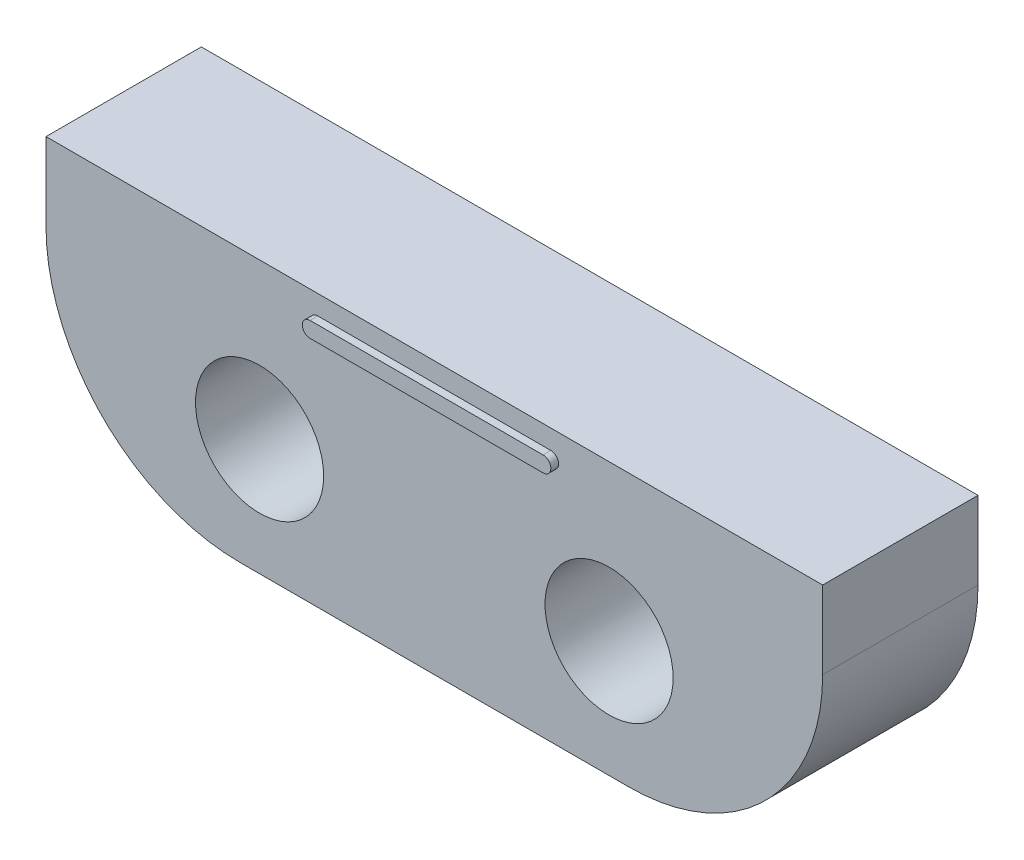
ISO-10303-21;
HEADER;
FILE_DESCRIPTION(('STEP AP214'),'2;1');
FILE_NAME('part.step','',(''),(''),'','','');
FILE_SCHEMA(('AUTOMOTIVE_DESIGN { 1 0 10303 214 1 1 1 1 }'));
ENDSEC;
DATA;
#1=APPLICATION_CONTEXT('core data for automotive mechanical design processes');
#2=APPLICATION_PROTOCOL_DEFINITION('international standard','automotive_design',2000,#1);
#3=PRODUCT_CONTEXT('',#1,'mechanical');
#4=PRODUCT('Part','Part','',(#3));
#5=PRODUCT_RELATED_PRODUCT_CATEGORY('part','',(#4));
#6=PRODUCT_DEFINITION_FORMATION('','',#4);
#7=PRODUCT_DEFINITION_CONTEXT('part definition',#1,'design');
#8=PRODUCT_DEFINITION('design','',#6,#7);
#9=PRODUCT_DEFINITION_SHAPE('','',#8);
#10=(LENGTH_UNIT() NAMED_UNIT(*) SI_UNIT(.MILLI.,.METRE.));
#11=(NAMED_UNIT(*) PLANE_ANGLE_UNIT() SI_UNIT($,.RADIAN.));
#12=(NAMED_UNIT(*) SI_UNIT($,.STERADIAN.) SOLID_ANGLE_UNIT());
#13=UNCERTAINTY_MEASURE_WITH_UNIT(LENGTH_MEASURE(1.E-05),#10,'distance_accuracy_value','');
#14=(GEOMETRIC_REPRESENTATION_CONTEXT(3) GLOBAL_UNCERTAINTY_ASSIGNED_CONTEXT((#13)) GLOBAL_UNIT_ASSIGNED_CONTEXT((#10,
#11,#12)) REPRESENTATION_CONTEXT('',''));
#15=CARTESIAN_POINT('',(0.,0.,0.));
#16=DIRECTION('',(0.,0.,1.));
#17=DIRECTION('',(1.,0.,0.));
#18=AXIS2_PLACEMENT_3D('',#15,#16,#17);
#19=CARTESIAN_POINT('',(0.,0.,4.));
#20=DIRECTION('',(0.,0.,1.));
#21=DIRECTION('',(1.,0.,0.));
#22=AXIS2_PLACEMENT_3D('',#19,#20,#21);
#23=PLANE('',#22);
#24=CARTESIAN_POINT('',(-4.5,0.,4.));
#25=DIRECTION('',(0.,0.,1.));
#26=DIRECTION('',(1.,0.,0.));
#27=AXIS2_PLACEMENT_3D('',#24,#25,#26);
#28=CIRCLE('',#27,1.65);
#29=CARTESIAN_POINT('',(-2.85,0.,4.));
#30=VERTEX_POINT('',#29);
#31=EDGE_CURVE('E166',#30,#30,#28,.T.);
#32=ORIENTED_EDGE('',*,*,#31,.F.);
#33=EDGE_LOOP('',(#32));
#34=FACE_BOUND('',#33,.T.);
#35=DIRECTION('',(0.,-1.,0.));
#36=VECTOR('',#35,1.);
#37=CARTESIAN_POINT('',(-10.,4.,4.));
#38=LINE('',#37,#36);
#39=CARTESIAN_POINT('',(-10.,4.,4.));
#40=VERTEX_POINT('',#39);
#41=CARTESIAN_POINT('',(-10.,2.,4.));
#42=VERTEX_POINT('',#41);
#43=EDGE_CURVE('E174',#40,#42,#38,.T.);
#44=ORIENTED_EDGE('',*,*,#43,.T.);
#45=CARTESIAN_POINT('',(-5.,2.,4.));
#46=DIRECTION('',(0.,0.,1.));
#47=DIRECTION('',(1.,0.,0.));
#48=AXIS2_PLACEMENT_3D('',#45,#46,#47);
#49=CIRCLE('',#48,5.);
#50=CARTESIAN_POINT('',(-5.,-3.,4.));
#51=VERTEX_POINT('',#50);
#52=EDGE_CURVE('E51',#42,#51,#49,.T.);
#53=ORIENTED_EDGE('',*,*,#52,.T.);
#54=DIRECTION('',(1.,0.,0.));
#55=VECTOR('',#54,1.);
#56=CARTESIAN_POINT('',(-10.,-3.,4.));
#57=LINE('',#56,#55);
#58=CARTESIAN_POINT('',(5.,-3.,4.));
#59=VERTEX_POINT('',#58);
#60=EDGE_CURVE('E177',#51,#59,#57,.T.);
#61=ORIENTED_EDGE('',*,*,#60,.T.);
#62=CARTESIAN_POINT('',(5.,2.,4.));
#63=DIRECTION('',(0.,0.,1.));
#64=DIRECTION('',(1.,0.,0.));
#65=AXIS2_PLACEMENT_3D('',#62,#63,#64);
#66=CIRCLE('',#65,5.);
#67=CARTESIAN_POINT('',(10.,2.,4.));
#68=VERTEX_POINT('',#67);
#69=EDGE_CURVE('E58',#59,#68,#66,.T.);
#70=ORIENTED_EDGE('',*,*,#69,.T.);
#71=DIRECTION('',(0.,1.,0.));
#72=VECTOR('',#71,1.);
#73=CARTESIAN_POINT('',(10.,4.,4.));
#74=LINE('',#73,#72);
#75=CARTESIAN_POINT('',(10.,4.,4.));
#76=VERTEX_POINT('',#75);
#77=EDGE_CURVE('E181',#68,#76,#74,.T.);
#78=ORIENTED_EDGE('',*,*,#77,.T.);
#79=DIRECTION('',(-1.,0.,0.));
#80=VECTOR('',#79,1.);
#81=CARTESIAN_POINT('',(-10.,4.,4.));
#82=LINE('',#81,#80);
#83=EDGE_CURVE('E184',#76,#40,#82,.T.);
#84=ORIENTED_EDGE('',*,*,#83,.T.);
#85=EDGE_LOOP('',(#44,#53,#61,#70,#78,#84));
#86=FACE_BOUND('',#85,.T.);
#87=CARTESIAN_POINT('',(4.5,0.,4.));
#88=DIRECTION('',(0.,0.,1.));
#89=DIRECTION('',(1.,0.,0.));
#90=AXIS2_PLACEMENT_3D('',#87,#88,#89);
#91=CIRCLE('',#90,1.65);
#92=CARTESIAN_POINT('',(6.15,0.,4.));
#93=VERTEX_POINT('',#92);
#94=EDGE_CURVE('E156',#93,#93,#91,.T.);
#95=ORIENTED_EDGE('',*,*,#94,.F.);
#96=EDGE_LOOP('',(#95));
#97=FACE_BOUND('',#96,.T.);
#98=DIRECTION('',(1.,0.,0.));
#99=VECTOR('',#98,1.);
#100=CARTESIAN_POINT('',(3.,3.1,4.));
#101=LINE('',#100,#99);
#102=CARTESIAN_POINT('',(-3.,3.1,4.));
#103=VERTEX_POINT('',#102);
#104=CARTESIAN_POINT('',(3.,3.1,4.));
#105=VERTEX_POINT('',#104);
#106=EDGE_CURVE('E415',#103,#105,#101,.T.);
#107=ORIENTED_EDGE('',*,*,#106,.F.);
#108=CARTESIAN_POINT('',(-3.,3.3,4.));
#109=DIRECTION('',(0.,0.,1.));
#110=DIRECTION('',(-1.,0.,0.));
#111=AXIS2_PLACEMENT_3D('',#108,#109,#110);
#112=CIRCLE('',#111,0.2);
#113=CARTESIAN_POINT('',(-3.,3.5,4.));
#114=VERTEX_POINT('',#113);
#115=EDGE_CURVE('E148',#114,#103,#112,.T.);
#116=ORIENTED_EDGE('',*,*,#115,.F.);
#117=DIRECTION('',(-1.,0.,0.));
#118=VECTOR('',#117,1.);
#119=CARTESIAN_POINT('',(-3.,3.5,4.));
#120=LINE('',#119,#118);
#121=CARTESIAN_POINT('',(3.,3.5,4.));
#122=VERTEX_POINT('',#121);
#123=EDGE_CURVE('E144',#122,#114,#120,.T.);
#124=ORIENTED_EDGE('',*,*,#123,.F.);
#125=CARTESIAN_POINT('',(3.,3.3,4.));
#126=DIRECTION('',(0.,0.,1.));
#127=DIRECTION('',(-1.,0.,0.));
#128=AXIS2_PLACEMENT_3D('',#125,#126,#127);
#129=CIRCLE('',#128,0.2);
#130=EDGE_CURVE('E418',#105,#122,#129,.T.);
#131=ORIENTED_EDGE('',*,*,#130,.F.);
#132=EDGE_LOOP('',(#107,#116,#124,#131));
#133=FACE_BOUND('',#132,.T.);
#134=ADVANCED_FACE('F42',(#34,#86,#97,#133),#23,.T.);
#135=CARTESIAN_POINT('',(0.,0.,0.));
#136=DIRECTION('',(0.,0.,1.));
#137=DIRECTION('',(1.,0.,0.));
#138=AXIS2_PLACEMENT_3D('',#135,#136,#137);
#139=PLANE('',#138);
#140=DIRECTION('',(1.,0.,0.));
#141=VECTOR('',#140,1.);
#142=CARTESIAN_POINT('',(-10.,-3.,0.));
#143=LINE('',#142,#141);
#144=CARTESIAN_POINT('',(-5.,-3.,0.));
#145=VERTEX_POINT('',#144);
#146=CARTESIAN_POINT('',(5.,-3.,0.));
#147=VERTEX_POINT('',#146);
#148=EDGE_CURVE('E190',#145,#147,#143,.T.);
#149=ORIENTED_EDGE('',*,*,#148,.F.);
#150=CARTESIAN_POINT('',(-5.,2.,0.));
#151=DIRECTION('',(0.,0.,1.));
#152=DIRECTION('',(1.,0.,0.));
#153=AXIS2_PLACEMENT_3D('',#150,#151,#152);
#154=CIRCLE('',#153,5.);
#155=CARTESIAN_POINT('',(-10.,2.,0.));
#156=VERTEX_POINT('',#155);
#157=EDGE_CURVE('E216',#145,#156,#154,.F.);
#158=ORIENTED_EDGE('',*,*,#157,.T.);
#159=DIRECTION('',(0.,-1.,0.));
#160=VECTOR('',#159,1.);
#161=CARTESIAN_POINT('',(-10.,4.,0.));
#162=LINE('',#161,#160);
#163=CARTESIAN_POINT('',(-10.,4.,0.));
#164=VERTEX_POINT('',#163);
#165=EDGE_CURVE('E170',#164,#156,#162,.T.);
#166=ORIENTED_EDGE('',*,*,#165,.F.);
#167=DIRECTION('',(-1.,0.,0.));
#168=VECTOR('',#167,1.);
#169=CARTESIAN_POINT('',(-10.,4.,0.));
#170=LINE('',#169,#168);
#171=CARTESIAN_POINT('',(10.,4.,0.));
#172=VERTEX_POINT('',#171);
#173=EDGE_CURVE('E178',#172,#164,#170,.T.);
#174=ORIENTED_EDGE('',*,*,#173,.F.);
#175=DIRECTION('',(0.,1.,0.));
#176=VECTOR('',#175,1.);
#177=CARTESIAN_POINT('',(10.,4.,0.));
#178=LINE('',#177,#176);
#179=CARTESIAN_POINT('',(10.,2.,0.));
#180=VERTEX_POINT('',#179);
#181=EDGE_CURVE('E194',#180,#172,#178,.T.);
#182=ORIENTED_EDGE('',*,*,#181,.F.);
#183=CARTESIAN_POINT('',(5.,2.,0.));
#184=DIRECTION('',(0.,0.,1.));
#185=DIRECTION('',(1.,0.,0.));
#186=AXIS2_PLACEMENT_3D('',#183,#184,#185);
#187=CIRCLE('',#186,5.);
#188=EDGE_CURVE('E213',#180,#147,#187,.F.);
#189=ORIENTED_EDGE('',*,*,#188,.T.);
#190=EDGE_LOOP('',(#149,#158,#166,#174,#182,#189));
#191=FACE_BOUND('',#190,.T.);
#192=CARTESIAN_POINT('',(-4.5,0.,0.));
#193=DIRECTION('',(0.,0.,1.));
#194=DIRECTION('',(1.,0.,0.));
#195=AXIS2_PLACEMENT_3D('',#192,#193,#194);
#196=CIRCLE('',#195,1.65);
#197=CARTESIAN_POINT('',(-2.85,0.,0.));
#198=VERTEX_POINT('',#197);
#199=EDGE_CURVE('E164',#198,#198,#196,.T.);
#200=ORIENTED_EDGE('',*,*,#199,.T.);
#201=EDGE_LOOP('',(#200));
#202=FACE_BOUND('',#201,.T.);
#203=CARTESIAN_POINT('',(4.5,0.,0.));
#204=DIRECTION('',(0.,0.,1.));
#205=DIRECTION('',(1.,0.,0.));
#206=AXIS2_PLACEMENT_3D('',#203,#204,#205);
#207=CIRCLE('',#206,1.65);
#208=CARTESIAN_POINT('',(6.15,0.,0.));
#209=VERTEX_POINT('',#208);
#210=EDGE_CURVE('E151',#209,#209,#207,.T.);
#211=ORIENTED_EDGE('',*,*,#210,.T.);
#212=EDGE_LOOP('',(#211));
#213=FACE_BOUND('',#212,.T.);
#214=ADVANCED_FACE('F235',(#191,#202,#213),#139,.F.);
#215=CARTESIAN_POINT('',(-10.,4.,4.));
#216=DIRECTION('',(1.,0.,0.));
#217=DIRECTION('',(0.,1.,0.));
#218=AXIS2_PLACEMENT_3D('',#215,#216,#217);
#219=PLANE('',#218);
#220=ORIENTED_EDGE('',*,*,#165,.T.);
#221=DIRECTION('',(0.,0.,-1.));
#222=VECTOR('',#221,1.);
#223=CARTESIAN_POINT('',(-10.,2.,4.));
#224=LINE('',#223,#222);
#225=EDGE_CURVE('E66',#156,#42,#224,.F.);
#226=ORIENTED_EDGE('',*,*,#225,.T.);
#227=ORIENTED_EDGE('',*,*,#43,.F.);
#228=DIRECTION('',(0.,0.,-1.));
#229=VECTOR('',#228,1.);
#230=CARTESIAN_POINT('',(-10.,4.,4.));
#231=LINE('',#230,#229);
#232=EDGE_CURVE('E187',#40,#164,#231,.T.);
#233=ORIENTED_EDGE('',*,*,#232,.T.);
#234=EDGE_LOOP('',(#220,#226,#227,#233));
#235=FACE_BOUND('',#234,.T.);
#236=ADVANCED_FACE('F238',(#235),#219,.F.);
#237=CARTESIAN_POINT('',(-10.,-3.,4.));
#238=DIRECTION('',(0.,1.,0.));
#239=DIRECTION('',(0.,0.,1.));
#240=AXIS2_PLACEMENT_3D('',#237,#238,#239);
#241=PLANE('',#240);
#242=ORIENTED_EDGE('',*,*,#60,.F.);
#243=DIRECTION('',(0.,0.,-1.));
#244=VECTOR('',#243,1.);
#245=CARTESIAN_POINT('',(-5.,-3.,4.));
#246=LINE('',#245,#244);
#247=EDGE_CURVE('E209',#51,#145,#246,.T.);
#248=ORIENTED_EDGE('',*,*,#247,.T.);
#249=ORIENTED_EDGE('',*,*,#148,.T.);
#250=DIRECTION('',(0.,0.,-1.));
#251=VECTOR('',#250,1.);
#252=CARTESIAN_POINT('',(5.,-3.,4.));
#253=LINE('',#252,#251);
#254=EDGE_CURVE('E206',#147,#59,#253,.F.);
#255=ORIENTED_EDGE('',*,*,#254,.T.);
#256=EDGE_LOOP('',(#242,#248,#249,#255));
#257=FACE_BOUND('',#256,.T.);
#258=ADVANCED_FACE('F229',(#257),#241,.F.);
#259=CARTESIAN_POINT('',(10.,4.,4.));
#260=DIRECTION('',(-1.,0.,0.));
#261=DIRECTION('',(0.,-1.,0.));
#262=AXIS2_PLACEMENT_3D('',#259,#260,#261);
#263=PLANE('',#262);
#264=ORIENTED_EDGE('',*,*,#77,.F.);
#265=DIRECTION('',(0.,0.,-1.));
#266=VECTOR('',#265,1.);
#267=CARTESIAN_POINT('',(10.,2.,4.));
#268=LINE('',#267,#266);
#269=EDGE_CURVE('E11',#68,#180,#268,.T.);
#270=ORIENTED_EDGE('',*,*,#269,.T.);
#271=ORIENTED_EDGE('',*,*,#181,.T.);
#272=DIRECTION('',(0.,0.,-1.));
#273=VECTOR('',#272,1.);
#274=CARTESIAN_POINT('',(10.,4.,4.));
#275=LINE('',#274,#273);
#276=EDGE_CURVE('E202',#76,#172,#275,.T.);
#277=ORIENTED_EDGE('',*,*,#276,.F.);
#278=EDGE_LOOP('',(#264,#270,#271,#277));
#279=FACE_BOUND('',#278,.T.);
#280=ADVANCED_FACE('F246',(#279),#263,.F.);
#281=CARTESIAN_POINT('',(-10.,4.,4.));
#282=DIRECTION('',(0.,-1.,0.));
#283=DIRECTION('',(0.,0.,-1.));
#284=AXIS2_PLACEMENT_3D('',#281,#282,#283);
#285=PLANE('',#284);
#286=ORIENTED_EDGE('',*,*,#173,.T.);
#287=ORIENTED_EDGE('',*,*,#232,.F.);
#288=ORIENTED_EDGE('',*,*,#83,.F.);
#289=ORIENTED_EDGE('',*,*,#276,.T.);
#290=EDGE_LOOP('',(#286,#287,#288,#289));
#291=FACE_BOUND('',#290,.T.);
#292=ADVANCED_FACE('F242',(#291),#285,.F.);
#293=CARTESIAN_POINT('',(-4.5,0.,4.));
#294=DIRECTION('',(0.,0.,-1.));
#295=DIRECTION('',(-1.,0.,0.));
#296=AXIS2_PLACEMENT_3D('',#293,#294,#295);
#297=CYLINDRICAL_SURFACE('',#296,1.65);
#298=ORIENTED_EDGE('',*,*,#31,.T.);
#299=EDGE_LOOP('',(#298));
#300=FACE_BOUND('',#299,.T.);
#301=ORIENTED_EDGE('',*,*,#199,.F.);
#302=EDGE_LOOP('',(#301));
#303=FACE_BOUND('',#302,.T.);
#304=ADVANCED_FACE('F263',(#300,#303),#297,.F.);
#305=CARTESIAN_POINT('',(4.5,0.,4.));
#306=DIRECTION('',(0.,0.,-1.));
#307=DIRECTION('',(-1.,0.,0.));
#308=AXIS2_PLACEMENT_3D('',#305,#306,#307);
#309=CYLINDRICAL_SURFACE('',#308,1.65);
#310=ORIENTED_EDGE('',*,*,#94,.T.);
#311=EDGE_LOOP('',(#310));
#312=FACE_BOUND('',#311,.T.);
#313=ORIENTED_EDGE('',*,*,#210,.F.);
#314=EDGE_LOOP('',(#313));
#315=FACE_BOUND('',#314,.T.);
#316=ADVANCED_FACE('F341',(#312,#315),#309,.F.);
#317=CARTESIAN_POINT('',(-3.,3.3,4.2));
#318=DIRECTION('',(0.,0.,-1.));
#319=DIRECTION('',(-1.,0.,0.));
#320=AXIS2_PLACEMENT_3D('',#317,#318,#319);
#321=CYLINDRICAL_SURFACE('',#320,0.2);
#322=ORIENTED_EDGE('',*,*,#115,.T.);
#323=DIRECTION('',(0.,0.,-1.));
#324=VECTOR('',#323,1.);
#325=CARTESIAN_POINT('',(-3.,3.1,4.2));
#326=LINE('',#325,#324);
#327=CARTESIAN_POINT('',(-3.,3.1,4.2));
#328=VERTEX_POINT('',#327);
#329=EDGE_CURVE('E126',#328,#103,#326,.T.);
#330=ORIENTED_EDGE('',*,*,#329,.F.);
#331=CARTESIAN_POINT('',(-3.,3.3,4.2));
#332=DIRECTION('',(0.,0.,1.));
#333=DIRECTION('',(-1.,0.,0.));
#334=AXIS2_PLACEMENT_3D('',#331,#332,#333);
#335=CIRCLE('',#334,0.2);
#336=CARTESIAN_POINT('',(-3.,3.5,4.2));
#337=VERTEX_POINT('',#336);
#338=EDGE_CURVE('E134',#337,#328,#335,.T.);
#339=ORIENTED_EDGE('',*,*,#338,.F.);
#340=DIRECTION('',(0.,0.,-1.));
#341=VECTOR('',#340,1.);
#342=CARTESIAN_POINT('',(-3.,3.5,4.2));
#343=LINE('',#342,#341);
#344=EDGE_CURVE('E429',#337,#114,#343,.T.);
#345=ORIENTED_EDGE('',*,*,#344,.T.);
#346=EDGE_LOOP('',(#322,#330,#339,#345));
#347=FACE_BOUND('',#346,.T.);
#348=ADVANCED_FACE('F146',(#347),#321,.T.);
#349=CARTESIAN_POINT('',(3.,3.1,4.2));
#350=DIRECTION('',(0.,1.,0.));
#351=DIRECTION('',(0.,0.,1.));
#352=AXIS2_PLACEMENT_3D('',#349,#350,#351);
#353=PLANE('',#352);
#354=ORIENTED_EDGE('',*,*,#106,.T.);
#355=DIRECTION('',(0.,0.,-1.));
#356=VECTOR('',#355,1.);
#357=CARTESIAN_POINT('',(3.,3.1,4.2));
#358=LINE('',#357,#356);
#359=CARTESIAN_POINT('',(3.,3.1,4.2));
#360=VERTEX_POINT('',#359);
#361=EDGE_CURVE('E129',#360,#105,#358,.T.);
#362=ORIENTED_EDGE('',*,*,#361,.F.);
#363=DIRECTION('',(1.,0.,0.));
#364=VECTOR('',#363,1.);
#365=CARTESIAN_POINT('',(3.,3.1,4.2));
#366=LINE('',#365,#364);
#367=EDGE_CURVE('E122',#328,#360,#366,.T.);
#368=ORIENTED_EDGE('',*,*,#367,.F.);
#369=ORIENTED_EDGE('',*,*,#329,.T.);
#370=EDGE_LOOP('',(#354,#362,#368,#369));
#371=FACE_BOUND('',#370,.T.);
#372=ADVANCED_FACE('F124',(#371),#353,.F.);
#373=CARTESIAN_POINT('',(3.,3.3,4.2));
#374=DIRECTION('',(0.,0.,-1.));
#375=DIRECTION('',(-1.,0.,0.));
#376=AXIS2_PLACEMENT_3D('',#373,#374,#375);
#377=CYLINDRICAL_SURFACE('',#376,0.2);
#378=ORIENTED_EDGE('',*,*,#130,.T.);
#379=DIRECTION('',(0.,0.,-1.));
#380=VECTOR('',#379,1.);
#381=CARTESIAN_POINT('',(3.,3.5,4.2));
#382=LINE('',#381,#380);
#383=CARTESIAN_POINT('',(3.,3.5,4.2));
#384=VERTEX_POINT('',#383);
#385=EDGE_CURVE('E158',#384,#122,#382,.T.);
#386=ORIENTED_EDGE('',*,*,#385,.F.);
#387=CARTESIAN_POINT('',(3.,3.3,4.2));
#388=DIRECTION('',(0.,0.,1.));
#389=DIRECTION('',(-1.,0.,0.));
#390=AXIS2_PLACEMENT_3D('',#387,#388,#389);
#391=CIRCLE('',#390,0.2);
#392=EDGE_CURVE('E133',#360,#384,#391,.T.);
#393=ORIENTED_EDGE('',*,*,#392,.F.);
#394=ORIENTED_EDGE('',*,*,#361,.T.);
#395=EDGE_LOOP('',(#378,#386,#393,#394));
#396=FACE_BOUND('',#395,.T.);
#397=ADVANCED_FACE('F314',(#396),#377,.T.);
#398=CARTESIAN_POINT('',(-3.,3.5,4.2));
#399=DIRECTION('',(0.,-1.,0.));
#400=DIRECTION('',(0.,0.,-1.));
#401=AXIS2_PLACEMENT_3D('',#398,#399,#400);
#402=PLANE('',#401);
#403=ORIENTED_EDGE('',*,*,#123,.T.);
#404=ORIENTED_EDGE('',*,*,#344,.F.);
#405=DIRECTION('',(-1.,0.,0.));
#406=VECTOR('',#405,1.);
#407=CARTESIAN_POINT('',(-3.,3.5,4.2));
#408=LINE('',#407,#406);
#409=EDGE_CURVE('E139',#384,#337,#408,.T.);
#410=ORIENTED_EDGE('',*,*,#409,.F.);
#411=ORIENTED_EDGE('',*,*,#385,.T.);
#412=EDGE_LOOP('',(#403,#404,#410,#411));
#413=FACE_BOUND('',#412,.T.);
#414=ADVANCED_FACE('F306',(#413),#402,.F.);
#415=CARTESIAN_POINT('',(-3.,3.3,4.2));
#416=DIRECTION('',(0.,0.,-1.));
#417=DIRECTION('',(-1.,0.,0.));
#418=AXIS2_PLACEMENT_3D('',#415,#416,#417);
#419=PLANE('',#418);
#420=ORIENTED_EDGE('',*,*,#338,.T.);
#421=ORIENTED_EDGE('',*,*,#367,.T.);
#422=ORIENTED_EDGE('',*,*,#392,.T.);
#423=ORIENTED_EDGE('',*,*,#409,.T.);
#424=EDGE_LOOP('',(#420,#421,#422,#423));
#425=FACE_BOUND('',#424,.T.);
#426=ADVANCED_FACE('F137',(#425),#419,.F.);
#427=CARTESIAN_POINT('',(-5.,2.,4.));
#428=DIRECTION('',(0.,0.,-1.));
#429=DIRECTION('',(-1.,0.,0.));
#430=AXIS2_PLACEMENT_3D('',#427,#428,#429);
#431=CYLINDRICAL_SURFACE('',#430,5.);
#432=ORIENTED_EDGE('',*,*,#52,.F.);
#433=ORIENTED_EDGE('',*,*,#225,.F.);
#434=ORIENTED_EDGE('',*,*,#157,.F.);
#435=ORIENTED_EDGE('',*,*,#247,.F.);
#436=EDGE_LOOP('',(#432,#433,#434,#435));
#437=FACE_BOUND('',#436,.T.);
#438=ADVANCED_FACE('F232',(#437),#431,.T.);
#439=CARTESIAN_POINT('',(5.,2.,4.));
#440=DIRECTION('',(0.,0.,-1.));
#441=DIRECTION('',(-1.,0.,0.));
#442=AXIS2_PLACEMENT_3D('',#439,#440,#441);
#443=CYLINDRICAL_SURFACE('',#442,5.);
#444=ORIENTED_EDGE('',*,*,#69,.F.);
#445=ORIENTED_EDGE('',*,*,#254,.F.);
#446=ORIENTED_EDGE('',*,*,#188,.F.);
#447=ORIENTED_EDGE('',*,*,#269,.F.);
#448=EDGE_LOOP('',(#444,#445,#446,#447));
#449=FACE_BOUND('',#448,.T.);
#450=ADVANCED_FACE('F44',(#449),#443,.T.);
#451=CLOSED_SHELL('',(#134,#214,#236,#258,#280,#292,#304,#316,#348,#372,#397,#414,#426,#438,#450));
#452=MANIFOLD_SOLID_BREP('B2',#451);
#453=ADVANCED_BREP_SHAPE_REPRESENTATION('',(#18,#452),#14);
#454=SHAPE_DEFINITION_REPRESENTATION(#9,#453);
ENDSEC;
END-ISO-10303-21;
